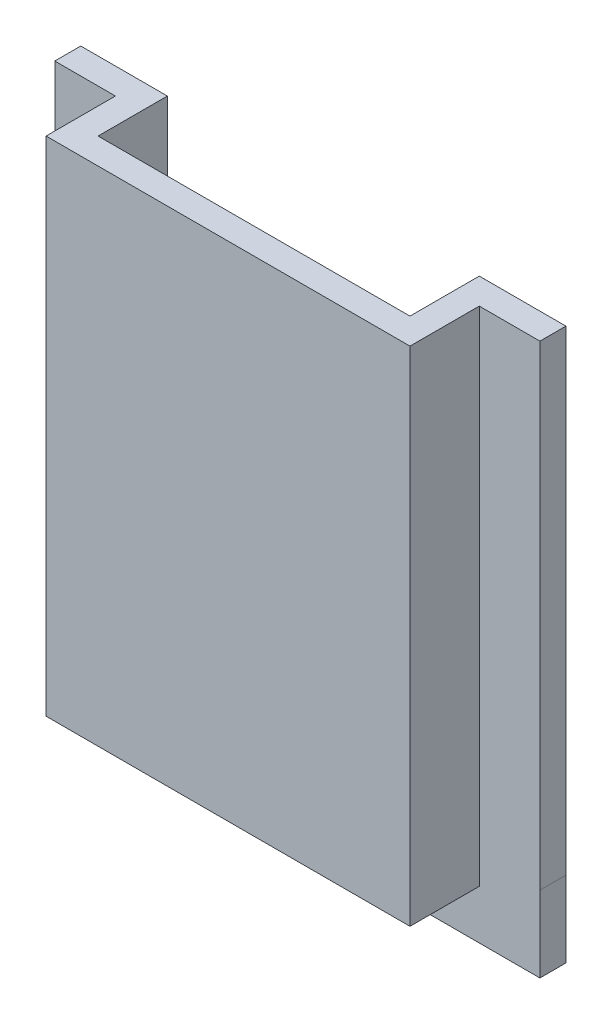
ISO-10303-21;
HEADER;
FILE_DESCRIPTION(('STEP AP214'),'2;1');
FILE_NAME('part.step','',(''),(''),'','','');
FILE_SCHEMA(('AUTOMOTIVE_DESIGN { 1 0 10303 214 1 1 1 1 }'));
ENDSEC;
DATA;
#1=APPLICATION_CONTEXT('core data for automotive mechanical design processes');
#2=APPLICATION_PROTOCOL_DEFINITION('international standard','automotive_design',2000,#1);
#3=PRODUCT_CONTEXT('',#1,'mechanical');
#4=PRODUCT('Part','Part','',(#3));
#5=PRODUCT_RELATED_PRODUCT_CATEGORY('part','',(#4));
#6=PRODUCT_DEFINITION_FORMATION('','',#4);
#7=PRODUCT_DEFINITION_CONTEXT('part definition',#1,'design');
#8=PRODUCT_DEFINITION('design','',#6,#7);
#9=PRODUCT_DEFINITION_SHAPE('','',#8);
#10=(LENGTH_UNIT() NAMED_UNIT(*) SI_UNIT(.MILLI.,.METRE.));
#11=(NAMED_UNIT(*) PLANE_ANGLE_UNIT() SI_UNIT($,.RADIAN.));
#12=(NAMED_UNIT(*) SI_UNIT($,.STERADIAN.) SOLID_ANGLE_UNIT());
#13=UNCERTAINTY_MEASURE_WITH_UNIT(LENGTH_MEASURE(1.E-05),#10,'distance_accuracy_value','');
#14=(GEOMETRIC_REPRESENTATION_CONTEXT(3) GLOBAL_UNCERTAINTY_ASSIGNED_CONTEXT((#13)) GLOBAL_UNIT_ASSIGNED_CONTEXT((#10,
#11,#12)) REPRESENTATION_CONTEXT('',''));
#15=CARTESIAN_POINT('',(0.,0.,0.));
#16=DIRECTION('',(0.,0.,1.));
#17=DIRECTION('',(1.,0.,0.));
#18=AXIS2_PLACEMENT_3D('',#15,#16,#17);
#19=CARTESIAN_POINT('',(0.,0.,0.));
#20=DIRECTION('',(0.,0.,1.));
#21=DIRECTION('',(1.,0.,0.));
#22=AXIS2_PLACEMENT_3D('',#19,#20,#21);
#23=PLANE('',#22);
#24=DIRECTION('',(1.,0.,0.));
#25=VECTOR('',#24,1.);
#26=CARTESIAN_POINT('',(18.,-26.1511757048325,0.));
#27=LINE('',#26,#25);
#28=CARTESIAN_POINT('',(-18.,-26.1511757048325,0.));
#29=VERTEX_POINT('',#28);
#30=CARTESIAN_POINT('',(18.,-26.1511757048325,0.));
#31=VERTEX_POINT('',#30);
#32=EDGE_CURVE('E199',#29,#31,#27,.T.);
#33=ORIENTED_EDGE('',*,*,#32,.F.);
#34=DIRECTION('',(0.,-1.,0.));
#35=VECTOR('',#34,1.);
#36=CARTESIAN_POINT('',(-18.,27.5,0.));
#37=LINE('',#36,#35);
#38=CARTESIAN_POINT('',(-18.,27.5,0.));
#39=VERTEX_POINT('',#38);
#40=EDGE_CURVE('E208',#39,#29,#37,.T.);
#41=ORIENTED_EDGE('',*,*,#40,.F.);
#42=DIRECTION('',(-1.,0.,0.));
#43=VECTOR('',#42,1.);
#44=CARTESIAN_POINT('',(-21.,27.5,0.));
#45=LINE('',#44,#43);
#46=CARTESIAN_POINT('',(18.,27.5,0.));
#47=VERTEX_POINT('',#46);
#48=EDGE_CURVE('E233',#47,#39,#45,.T.);
#49=ORIENTED_EDGE('',*,*,#48,.F.);
#50=DIRECTION('',(0.,1.,0.));
#51=VECTOR('',#50,1.);
#52=CARTESIAN_POINT('',(18.,27.5,0.));
#53=LINE('',#52,#51);
#54=EDGE_CURVE('E218',#31,#47,#53,.T.);
#55=ORIENTED_EDGE('',*,*,#54,.F.);
#56=EDGE_LOOP('',(#33,#41,#49,#55));
#57=FACE_BOUND('',#56,.T.);
#58=ADVANCED_FACE('F33',(#57),#23,.F.);
#59=CARTESIAN_POINT('',(18.,27.5,-8.));
#60=DIRECTION('',(1.,0.,0.));
#61=DIRECTION('',(0.,1.,0.));
#62=AXIS2_PLACEMENT_3D('',#59,#60,#61);
#63=PLANE('',#62);
#64=ORIENTED_EDGE('',*,*,#54,.T.);
#65=DIRECTION('',(0.,0.,1.));
#66=VECTOR('',#65,1.);
#67=CARTESIAN_POINT('',(18.,27.5,-8.));
#68=LINE('',#67,#66);
#69=CARTESIAN_POINT('',(18.,27.5,-8.));
#70=VERTEX_POINT('',#69);
#71=EDGE_CURVE('E223',#70,#47,#68,.T.);
#72=ORIENTED_EDGE('',*,*,#71,.F.);
#73=DIRECTION('',(0.,1.,0.));
#74=VECTOR('',#73,1.);
#75=CARTESIAN_POINT('',(18.,27.5,-8.));
#76=LINE('',#75,#74);
#77=CARTESIAN_POINT('',(18.,-26.1511757048325,-8.));
#78=VERTEX_POINT('',#77);
#79=EDGE_CURVE('E219',#78,#70,#76,.T.);
#80=ORIENTED_EDGE('',*,*,#79,.F.);
#81=DIRECTION('',(0.,0.,1.));
#82=VECTOR('',#81,1.);
#83=CARTESIAN_POINT('',(18.,-26.1511757048325,-8.));
#84=LINE('',#83,#82);
#85=EDGE_CURVE('E202',#78,#31,#84,.T.);
#86=ORIENTED_EDGE('',*,*,#85,.T.);
#87=EDGE_LOOP('',(#64,#72,#80,#86));
#88=FACE_BOUND('',#87,.T.);
#89=ADVANCED_FACE('F279',(#88),#63,.F.);
#90=CARTESIAN_POINT('',(-18.,27.5,-8.));
#91=DIRECTION('',(-1.,0.,0.));
#92=DIRECTION('',(0.,-1.,0.));
#93=AXIS2_PLACEMENT_3D('',#90,#91,#92);
#94=PLANE('',#93);
#95=DIRECTION('',(0.,0.,1.));
#96=VECTOR('',#95,1.);
#97=CARTESIAN_POINT('',(-18.,27.5,-8.));
#98=LINE('',#97,#96);
#99=CARTESIAN_POINT('',(-18.,27.5,-8.));
#100=VERTEX_POINT('',#99);
#101=EDGE_CURVE('E214',#100,#39,#98,.T.);
#102=ORIENTED_EDGE('',*,*,#101,.T.);
#103=ORIENTED_EDGE('',*,*,#40,.T.);
#104=DIRECTION('',(0.,0.,1.));
#105=VECTOR('',#104,1.);
#106=CARTESIAN_POINT('',(-18.,-26.1511757048325,-8.));
#107=LINE('',#106,#105);
#108=CARTESIAN_POINT('',(-18.,-26.1511757048325,-8.));
#109=VERTEX_POINT('',#108);
#110=EDGE_CURVE('E206',#109,#29,#107,.T.);
#111=ORIENTED_EDGE('',*,*,#110,.F.);
#112=DIRECTION('',(0.,-1.,0.));
#113=VECTOR('',#112,1.);
#114=CARTESIAN_POINT('',(-18.,27.5,-8.));
#115=LINE('',#114,#113);
#116=EDGE_CURVE('E211',#100,#109,#115,.T.);
#117=ORIENTED_EDGE('',*,*,#116,.F.);
#118=EDGE_LOOP('',(#102,#103,#111,#117));
#119=FACE_BOUND('',#118,.T.);
#120=ADVANCED_FACE('F284',(#119),#94,.F.);
#121=CARTESIAN_POINT('',(-21.,27.5,3.));
#122=DIRECTION('',(1.,0.,0.));
#123=DIRECTION('',(0.,1.,0.));
#124=AXIS2_PLACEMENT_3D('',#121,#122,#123);
#125=PLANE('',#124);
#126=DIRECTION('',(0.,1.,0.));
#127=VECTOR('',#126,1.);
#128=CARTESIAN_POINT('',(-21.,27.5,-5.));
#129=LINE('',#128,#127);
#130=CARTESIAN_POINT('',(-21.,-30.5,-5.));
#131=VERTEX_POINT('',#130);
#132=CARTESIAN_POINT('',(-21.,27.5,-5.));
#133=VERTEX_POINT('',#132);
#134=EDGE_CURVE('E197',#131,#133,#129,.T.);
#135=ORIENTED_EDGE('',*,*,#134,.F.);
#136=DIRECTION('',(0.,0.,-1.));
#137=VECTOR('',#136,1.);
#138=CARTESIAN_POINT('',(-21.,-30.5,3.));
#139=LINE('',#138,#137);
#140=CARTESIAN_POINT('',(-21.,-30.5,3.));
#141=VERTEX_POINT('',#140);
#142=EDGE_CURVE('E41',#141,#131,#139,.T.);
#143=ORIENTED_EDGE('',*,*,#142,.F.);
#144=DIRECTION('',(0.,-1.,0.));
#145=VECTOR('',#144,1.);
#146=CARTESIAN_POINT('',(-21.,27.5,3.));
#147=LINE('',#146,#145);
#148=CARTESIAN_POINT('',(-21.,27.5,3.));
#149=VERTEX_POINT('',#148);
#150=EDGE_CURVE('E226',#149,#141,#147,.T.);
#151=ORIENTED_EDGE('',*,*,#150,.F.);
#152=DIRECTION('',(0.,0.,-1.));
#153=VECTOR('',#152,1.);
#154=CARTESIAN_POINT('',(-21.,27.5,3.));
#155=LINE('',#154,#153);
#156=EDGE_CURVE('E242',#149,#133,#155,.T.);
#157=ORIENTED_EDGE('',*,*,#156,.T.);
#158=EDGE_LOOP('',(#135,#143,#151,#157));
#159=FACE_BOUND('',#158,.T.);
#160=ADVANCED_FACE('F35',(#159),#125,.F.);
#161=CARTESIAN_POINT('',(-21.,-30.5,3.));
#162=DIRECTION('',(0.,1.,0.));
#163=DIRECTION('',(0.,0.,1.));
#164=AXIS2_PLACEMENT_3D('',#161,#162,#163);
#165=PLANE('',#164);
#166=ORIENTED_EDGE('',*,*,#142,.T.);
#167=DIRECTION('',(1.,0.,0.));
#168=VECTOR('',#167,1.);
#169=CARTESIAN_POINT('',(-21.,-30.5,-5.));
#170=LINE('',#169,#168);
#171=CARTESIAN_POINT('',(21.,-30.5,-5.));
#172=VERTEX_POINT('',#171);
#173=EDGE_CURVE('E163',#131,#172,#170,.T.);
#174=ORIENTED_EDGE('',*,*,#173,.T.);
#175=DIRECTION('',(0.,0.,-1.));
#176=VECTOR('',#175,1.);
#177=CARTESIAN_POINT('',(21.,-30.5,3.));
#178=LINE('',#177,#176);
#179=CARTESIAN_POINT('',(21.,-30.5,3.));
#180=VERTEX_POINT('',#179);
#181=EDGE_CURVE('E247',#180,#172,#178,.T.);
#182=ORIENTED_EDGE('',*,*,#181,.F.);
#183=DIRECTION('',(1.,0.,0.));
#184=VECTOR('',#183,1.);
#185=CARTESIAN_POINT('',(-21.,-30.5,3.));
#186=LINE('',#185,#184);
#187=EDGE_CURVE('E256',#141,#180,#186,.T.);
#188=ORIENTED_EDGE('',*,*,#187,.F.);
#189=EDGE_LOOP('',(#166,#174,#182,#188));
#190=FACE_BOUND('',#189,.T.);
#191=ADVANCED_FACE('F254',(#190),#165,.F.);
#192=CARTESIAN_POINT('',(21.,27.5,3.));
#193=DIRECTION('',(-1.,0.,0.));
#194=DIRECTION('',(0.,-1.,0.));
#195=AXIS2_PLACEMENT_3D('',#192,#193,#194);
#196=PLANE('',#195);
#197=ORIENTED_EDGE('',*,*,#181,.T.);
#198=DIRECTION('',(0.,1.,0.));
#199=VECTOR('',#198,1.);
#200=CARTESIAN_POINT('',(21.,27.5,-5.));
#201=LINE('',#200,#199);
#202=CARTESIAN_POINT('',(21.,27.5,-5.));
#203=VERTEX_POINT('',#202);
#204=EDGE_CURVE('E183',#172,#203,#201,.T.);
#205=ORIENTED_EDGE('',*,*,#204,.T.);
#206=DIRECTION('',(0.,0.,-1.));
#207=VECTOR('',#206,1.);
#208=CARTESIAN_POINT('',(21.,27.5,3.));
#209=LINE('',#208,#207);
#210=CARTESIAN_POINT('',(21.,27.5,3.));
#211=VERTEX_POINT('',#210);
#212=EDGE_CURVE('E245',#211,#203,#209,.T.);
#213=ORIENTED_EDGE('',*,*,#212,.F.);
#214=DIRECTION('',(0.,1.,0.));
#215=VECTOR('',#214,1.);
#216=CARTESIAN_POINT('',(21.,27.5,3.));
#217=LINE('',#216,#215);
#218=EDGE_CURVE('E53',#180,#211,#217,.T.);
#219=ORIENTED_EDGE('',*,*,#218,.F.);
#220=EDGE_LOOP('',(#197,#205,#213,#219));
#221=FACE_BOUND('',#220,.T.);
#222=ADVANCED_FACE('F261',(#221),#196,.F.);
#223=CARTESIAN_POINT('',(-21.,27.5,3.));
#224=DIRECTION('',(0.,-1.,0.));
#225=DIRECTION('',(0.,0.,-1.));
#226=AXIS2_PLACEMENT_3D('',#223,#224,#225);
#227=PLANE('',#226);
#228=ORIENTED_EDGE('',*,*,#212,.T.);
#229=DIRECTION('',(1.,0.,0.));
#230=VECTOR('',#229,1.);
#231=CARTESIAN_POINT('',(18.,27.5,-5.));
#232=LINE('',#231,#230);
#233=CARTESIAN_POINT('',(28.,27.5,-5.));
#234=VERTEX_POINT('',#233);
#235=EDGE_CURVE('E168',#203,#234,#232,.T.);
#236=ORIENTED_EDGE('',*,*,#235,.T.);
#237=DIRECTION('',(0.,0.,-1.));
#238=VECTOR('',#237,1.);
#239=CARTESIAN_POINT('',(28.,27.5,-5.));
#240=LINE('',#239,#238);
#241=CARTESIAN_POINT('',(28.,27.5,-8.));
#242=VERTEX_POINT('',#241);
#243=EDGE_CURVE('E176',#234,#242,#240,.T.);
#244=ORIENTED_EDGE('',*,*,#243,.T.);
#245=DIRECTION('',(1.,0.,0.));
#246=VECTOR('',#245,1.);
#247=CARTESIAN_POINT('',(21.,27.5,-8.));
#248=LINE('',#247,#246);
#249=EDGE_CURVE('E221',#70,#242,#248,.T.);
#250=ORIENTED_EDGE('',*,*,#249,.F.);
#251=ORIENTED_EDGE('',*,*,#71,.T.);
#252=ORIENTED_EDGE('',*,*,#48,.T.);
#253=ORIENTED_EDGE('',*,*,#101,.F.);
#254=DIRECTION('',(1.,0.,0.));
#255=VECTOR('',#254,1.);
#256=CARTESIAN_POINT('',(-21.,27.5,-8.));
#257=LINE('',#256,#255);
#258=CARTESIAN_POINT('',(-28.,27.5,-8.));
#259=VERTEX_POINT('',#258);
#260=EDGE_CURVE('E209',#259,#100,#257,.T.);
#261=ORIENTED_EDGE('',*,*,#260,.F.);
#262=DIRECTION('',(0.,0.,-1.));
#263=VECTOR('',#262,1.);
#264=CARTESIAN_POINT('',(-28.,27.5,-5.));
#265=LINE('',#264,#263);
#266=CARTESIAN_POINT('',(-28.,27.5,-5.));
#267=VERTEX_POINT('',#266);
#268=EDGE_CURVE('E192',#267,#259,#265,.T.);
#269=ORIENTED_EDGE('',*,*,#268,.F.);
#270=DIRECTION('',(1.,0.,0.));
#271=VECTOR('',#270,1.);
#272=CARTESIAN_POINT('',(-18.,27.5,-5.));
#273=LINE('',#272,#271);
#274=EDGE_CURVE('E189',#267,#133,#273,.T.);
#275=ORIENTED_EDGE('',*,*,#274,.T.);
#276=ORIENTED_EDGE('',*,*,#156,.F.);
#277=DIRECTION('',(-1.,0.,0.));
#278=VECTOR('',#277,1.);
#279=CARTESIAN_POINT('',(-21.,27.5,3.));
#280=LINE('',#279,#278);
#281=EDGE_CURVE('E48',#211,#149,#280,.T.);
#282=ORIENTED_EDGE('',*,*,#281,.F.);
#283=EDGE_LOOP('',(#228,#236,#244,#250,#251,#252,#253,#261,#269,#275,#276,#282));
#284=FACE_BOUND('',#283,.T.);
#285=ADVANCED_FACE('F263',(#284),#227,.F.);
#286=CARTESIAN_POINT('',(0.,0.,3.));
#287=DIRECTION('',(0.,0.,1.));
#288=DIRECTION('',(1.,0.,0.));
#289=AXIS2_PLACEMENT_3D('',#286,#287,#288);
#290=PLANE('',#289);
#291=ORIENTED_EDGE('',*,*,#150,.T.);
#292=ORIENTED_EDGE('',*,*,#187,.T.);
#293=ORIENTED_EDGE('',*,*,#218,.T.);
#294=ORIENTED_EDGE('',*,*,#281,.T.);
#295=EDGE_LOOP('',(#291,#292,#293,#294));
#296=FACE_BOUND('',#295,.T.);
#297=ADVANCED_FACE('F264',(#296),#290,.T.);
#298=CARTESIAN_POINT('',(0.,0.,-8.));
#299=DIRECTION('',(0.,0.,-1.));
#300=DIRECTION('',(-1.,0.,0.));
#301=AXIS2_PLACEMENT_3D('',#298,#299,#300);
#302=PLANE('',#301);
#303=DIRECTION('',(-1.,0.,0.));
#304=VECTOR('',#303,1.);
#305=CARTESIAN_POINT('',(18.,-27.3835185787519,-8.));
#306=LINE('',#305,#304);
#307=CARTESIAN_POINT('',(28.,-27.3835185787519,-8.));
#308=VERTEX_POINT('',#307);
#309=CARTESIAN_POINT('',(27.9971522076323,-27.3835185787519,-8.));
#310=VERTEX_POINT('',#309);
#311=EDGE_CURVE('E171',#308,#310,#306,.T.);
#312=ORIENTED_EDGE('',*,*,#311,.T.);
#313=DIRECTION('',(0.,-1.,0.));
#314=VECTOR('',#313,1.);
#315=CARTESIAN_POINT('',(27.9971522076323,-26.166567445614,-8.));
#316=LINE('',#315,#314);
#317=CARTESIAN_POINT('',(27.9971522076323,-36.166567445614,-8.));
#318=VERTEX_POINT('',#317);
#319=EDGE_CURVE('E160',#310,#318,#316,.T.);
#320=ORIENTED_EDGE('',*,*,#319,.T.);
#321=DIRECTION('',(-1.,0.,0.));
#322=VECTOR('',#321,1.);
#323=CARTESIAN_POINT('',(-28.,-36.166567445614,-8.));
#324=LINE('',#323,#322);
#325=CARTESIAN_POINT('',(-28.,-36.166567445614,-8.));
#326=VERTEX_POINT('',#325);
#327=EDGE_CURVE('E144',#318,#326,#324,.T.);
#328=ORIENTED_EDGE('',*,*,#327,.T.);
#329=DIRECTION('',(0.,1.,0.));
#330=VECTOR('',#329,1.);
#331=CARTESIAN_POINT('',(-28.,27.5,-8.));
#332=LINE('',#331,#330);
#333=EDGE_CURVE('E187',#326,#259,#332,.T.);
#334=ORIENTED_EDGE('',*,*,#333,.T.);
#335=ORIENTED_EDGE('',*,*,#260,.T.);
#336=ORIENTED_EDGE('',*,*,#116,.T.);
#337=DIRECTION('',(1.,0.,0.));
#338=VECTOR('',#337,1.);
#339=CARTESIAN_POINT('',(18.,-26.1511757048325,-8.));
#340=LINE('',#339,#338);
#341=EDGE_CURVE('E200',#109,#78,#340,.T.);
#342=ORIENTED_EDGE('',*,*,#341,.T.);
#343=ORIENTED_EDGE('',*,*,#79,.T.);
#344=ORIENTED_EDGE('',*,*,#249,.T.);
#345=DIRECTION('',(0.,-1.,0.));
#346=VECTOR('',#345,1.);
#347=CARTESIAN_POINT('',(28.,27.5,-8.));
#348=LINE('',#347,#346);
#349=EDGE_CURVE('E167',#242,#308,#348,.T.);
#350=ORIENTED_EDGE('',*,*,#349,.T.);
#351=EDGE_LOOP('',(#312,#320,#328,#334,#335,#336,#342,#343,#344,#350));
#352=FACE_BOUND('',#351,.T.);
#353=ADVANCED_FACE('F266',(#352),#302,.T.);
#354=CARTESIAN_POINT('',(18.,-26.1511757048325,-8.));
#355=DIRECTION('',(0.,-1.,0.));
#356=DIRECTION('',(0.,0.,-1.));
#357=AXIS2_PLACEMENT_3D('',#354,#355,#356);
#358=PLANE('',#357);
#359=ORIENTED_EDGE('',*,*,#341,.F.);
#360=ORIENTED_EDGE('',*,*,#110,.T.);
#361=ORIENTED_EDGE('',*,*,#32,.T.);
#362=ORIENTED_EDGE('',*,*,#85,.F.);
#363=EDGE_LOOP('',(#359,#360,#361,#362));
#364=FACE_BOUND('',#363,.T.);
#365=ADVANCED_FACE('F272',(#364),#358,.F.);
#366=CARTESIAN_POINT('',(0.,0.,-5.));
#367=DIRECTION('',(0.,0.,-1.));
#368=DIRECTION('',(-1.,0.,0.));
#369=AXIS2_PLACEMENT_3D('',#366,#367,#368);
#370=PLANE('',#369);
#371=DIRECTION('',(0.,1.,0.));
#372=VECTOR('',#371,1.);
#373=CARTESIAN_POINT('',(-28.,27.5,-5.));
#374=LINE('',#373,#372);
#375=CARTESIAN_POINT('',(-28.,-36.166567445614,-5.));
#376=VERTEX_POINT('',#375);
#377=EDGE_CURVE('E156',#376,#267,#374,.T.);
#378=ORIENTED_EDGE('',*,*,#377,.F.);
#379=DIRECTION('',(-1.,0.,0.));
#380=VECTOR('',#379,1.);
#381=CARTESIAN_POINT('',(-28.,-36.166567445614,-5.));
#382=LINE('',#381,#380);
#383=CARTESIAN_POINT('',(27.9971522076323,-36.166567445614,-5.));
#384=VERTEX_POINT('',#383);
#385=EDGE_CURVE('E143',#384,#376,#382,.T.);
#386=ORIENTED_EDGE('',*,*,#385,.F.);
#387=DIRECTION('',(0.,-1.,0.));
#388=VECTOR('',#387,1.);
#389=CARTESIAN_POINT('',(27.9971522076323,-26.166567445614,-5.));
#390=LINE('',#389,#388);
#391=CARTESIAN_POINT('',(27.9971522076323,-27.3835185787519,-5.));
#392=VERTEX_POINT('',#391);
#393=EDGE_CURVE('E133',#392,#384,#390,.T.);
#394=ORIENTED_EDGE('',*,*,#393,.F.);
#395=DIRECTION('',(-1.,0.,0.));
#396=VECTOR('',#395,1.);
#397=CARTESIAN_POINT('',(18.,-27.3835185787519,-5.));
#398=LINE('',#397,#396);
#399=CARTESIAN_POINT('',(28.,-27.3835185787519,-5.));
#400=VERTEX_POINT('',#399);
#401=EDGE_CURVE('E174',#400,#392,#398,.T.);
#402=ORIENTED_EDGE('',*,*,#401,.F.);
#403=DIRECTION('',(0.,-1.,0.));
#404=VECTOR('',#403,1.);
#405=CARTESIAN_POINT('',(28.,27.5,-5.));
#406=LINE('',#405,#404);
#407=EDGE_CURVE('E170',#234,#400,#406,.T.);
#408=ORIENTED_EDGE('',*,*,#407,.F.);
#409=ORIENTED_EDGE('',*,*,#235,.F.);
#410=ORIENTED_EDGE('',*,*,#204,.F.);
#411=ORIENTED_EDGE('',*,*,#173,.F.);
#412=ORIENTED_EDGE('',*,*,#134,.T.);
#413=ORIENTED_EDGE('',*,*,#274,.F.);
#414=EDGE_LOOP('',(#378,#386,#394,#402,#408,#409,#410,#411,#412,#413));
#415=FACE_BOUND('',#414,.T.);
#416=ADVANCED_FACE('F153',(#415),#370,.F.);
#417=CARTESIAN_POINT('',(-28.,27.5,-5.));
#418=DIRECTION('',(-1.,0.,0.));
#419=DIRECTION('',(0.,0.,1.));
#420=AXIS2_PLACEMENT_3D('',#417,#418,#419);
#421=PLANE('',#420);
#422=ORIENTED_EDGE('',*,*,#333,.F.);
#423=DIRECTION('',(0.,0.,-1.));
#424=VECTOR('',#423,1.);
#425=CARTESIAN_POINT('',(-28.,-36.166567445614,-5.));
#426=LINE('',#425,#424);
#427=EDGE_CURVE('E151',#376,#326,#426,.T.);
#428=ORIENTED_EDGE('',*,*,#427,.F.);
#429=ORIENTED_EDGE('',*,*,#377,.T.);
#430=ORIENTED_EDGE('',*,*,#268,.T.);
#431=EDGE_LOOP('',(#422,#428,#429,#430));
#432=FACE_BOUND('',#431,.T.);
#433=ADVANCED_FACE('F304',(#432),#421,.T.);
#434=CARTESIAN_POINT('',(18.,-27.3835185787519,-5.));
#435=DIRECTION('',(0.,-1.,0.));
#436=DIRECTION('',(0.,0.,-1.));
#437=AXIS2_PLACEMENT_3D('',#434,#435,#436);
#438=PLANE('',#437);
#439=DIRECTION('',(0.,0.,1.));
#440=VECTOR('',#439,1.);
#441=CARTESIAN_POINT('',(27.9971522076323,-27.3835185787519,-5.));
#442=LINE('',#441,#440);
#443=EDGE_CURVE('E11',#310,#392,#442,.T.);
#444=ORIENTED_EDGE('',*,*,#443,.F.);
#445=ORIENTED_EDGE('',*,*,#311,.F.);
#446=DIRECTION('',(0.,0.,-1.));
#447=VECTOR('',#446,1.);
#448=CARTESIAN_POINT('',(28.,-27.3835185787519,-5.));
#449=LINE('',#448,#447);
#450=EDGE_CURVE('E181',#400,#308,#449,.T.);
#451=ORIENTED_EDGE('',*,*,#450,.F.);
#452=ORIENTED_EDGE('',*,*,#401,.T.);
#453=EDGE_LOOP('',(#444,#445,#451,#452));
#454=FACE_BOUND('',#453,.T.);
#455=ADVANCED_FACE('F307',(#454),#438,.T.);
#456=CARTESIAN_POINT('',(28.,27.5,-5.));
#457=DIRECTION('',(1.,0.,0.));
#458=DIRECTION('',(0.,0.,-1.));
#459=AXIS2_PLACEMENT_3D('',#456,#457,#458);
#460=PLANE('',#459);
#461=ORIENTED_EDGE('',*,*,#349,.F.);
#462=ORIENTED_EDGE('',*,*,#243,.F.);
#463=ORIENTED_EDGE('',*,*,#407,.T.);
#464=ORIENTED_EDGE('',*,*,#450,.T.);
#465=EDGE_LOOP('',(#461,#462,#463,#464));
#466=FACE_BOUND('',#465,.T.);
#467=ADVANCED_FACE('F311',(#466),#460,.T.);
#468=CARTESIAN_POINT('',(-28.,-36.166567445614,-5.));
#469=DIRECTION('',(0.,-1.,0.));
#470=DIRECTION('',(1.,0.,0.));
#471=AXIS2_PLACEMENT_3D('',#468,#469,#470);
#472=PLANE('',#471);
#473=ORIENTED_EDGE('',*,*,#327,.F.);
#474=DIRECTION('',(0.,0.,-1.));
#475=VECTOR('',#474,1.);
#476=CARTESIAN_POINT('',(27.9971522076323,-36.166567445614,-5.));
#477=LINE('',#476,#475);
#478=EDGE_CURVE('E136',#384,#318,#477,.T.);
#479=ORIENTED_EDGE('',*,*,#478,.F.);
#480=ORIENTED_EDGE('',*,*,#385,.T.);
#481=ORIENTED_EDGE('',*,*,#427,.T.);
#482=EDGE_LOOP('',(#473,#479,#480,#481));
#483=FACE_BOUND('',#482,.T.);
#484=ADVANCED_FACE('F148',(#483),#472,.T.);
#485=CARTESIAN_POINT('',(27.9971522076323,-26.166567445614,-5.));
#486=DIRECTION('',(1.,0.,0.));
#487=DIRECTION('',(0.,0.,-1.));
#488=AXIS2_PLACEMENT_3D('',#485,#486,#487);
#489=PLANE('',#488);
#490=ORIENTED_EDGE('',*,*,#319,.F.);
#491=ORIENTED_EDGE('',*,*,#443,.T.);
#492=ORIENTED_EDGE('',*,*,#393,.T.);
#493=ORIENTED_EDGE('',*,*,#478,.T.);
#494=EDGE_LOOP('',(#490,#491,#492,#493));
#495=FACE_BOUND('',#494,.T.);
#496=ADVANCED_FACE('F135',(#495),#489,.T.);
#497=CLOSED_SHELL('',(#58,#89,#120,#160,#191,#222,#285,#297,#353,#365,#416,#433,#455,#467,#484,#496));
#498=MANIFOLD_SOLID_BREP('B2',#497);
#499=ADVANCED_BREP_SHAPE_REPRESENTATION('',(#18,#498),#14);
#500=SHAPE_DEFINITION_REPRESENTATION(#9,#499);
ENDSEC;
END-ISO-10303-21;
